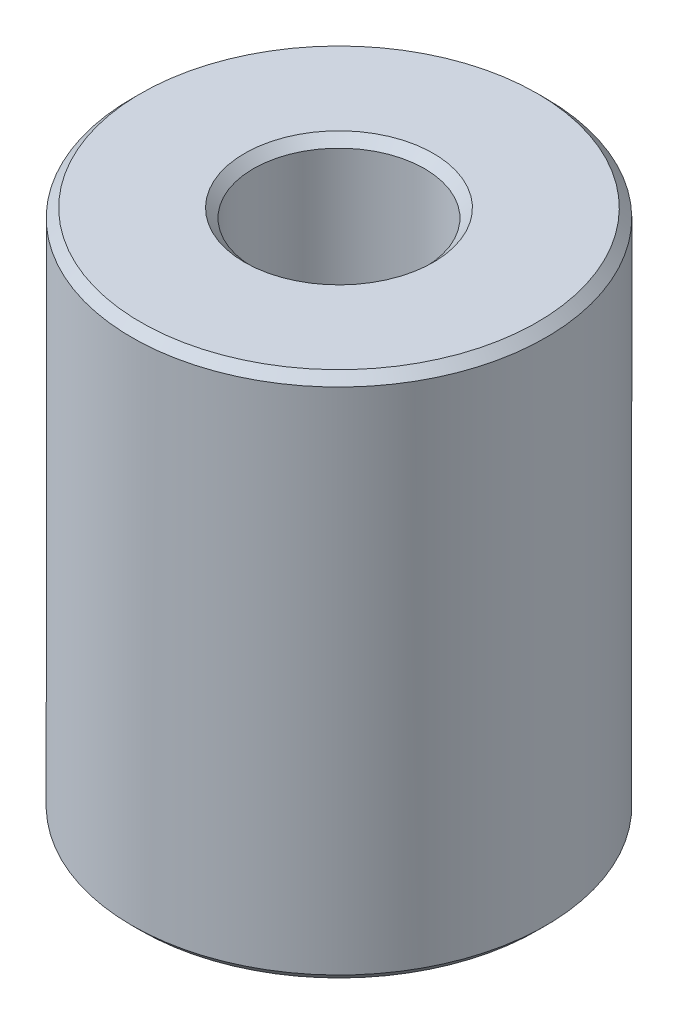
ISO-10303-21;
HEADER;
FILE_DESCRIPTION(('STEP AP214'),'2;1');
FILE_NAME('part.step','',(''),(''),'','','');
FILE_SCHEMA(('AUTOMOTIVE_DESIGN { 1 0 10303 214 1 1 1 1 }'));
ENDSEC;
DATA;
#1=APPLICATION_CONTEXT('core data for automotive mechanical design processes');
#2=APPLICATION_PROTOCOL_DEFINITION('international standard','automotive_design',2000,#1);
#3=PRODUCT_CONTEXT('',#1,'mechanical');
#4=PRODUCT('Part','Part','',(#3));
#5=PRODUCT_RELATED_PRODUCT_CATEGORY('part','',(#4));
#6=PRODUCT_DEFINITION_FORMATION('','',#4);
#7=PRODUCT_DEFINITION_CONTEXT('part definition',#1,'design');
#8=PRODUCT_DEFINITION('design','',#6,#7);
#9=PRODUCT_DEFINITION_SHAPE('','',#8);
#10=(LENGTH_UNIT() NAMED_UNIT(*) SI_UNIT(.MILLI.,.METRE.));
#11=(NAMED_UNIT(*) PLANE_ANGLE_UNIT() SI_UNIT($,.RADIAN.));
#12=(NAMED_UNIT(*) SI_UNIT($,.STERADIAN.) SOLID_ANGLE_UNIT());
#13=UNCERTAINTY_MEASURE_WITH_UNIT(LENGTH_MEASURE(1.E-05),#10,'distance_accuracy_value','');
#14=(GEOMETRIC_REPRESENTATION_CONTEXT(3) GLOBAL_UNCERTAINTY_ASSIGNED_CONTEXT((#13)) GLOBAL_UNIT_ASSIGNED_CONTEXT((#10,
#11,#12)) REPRESENTATION_CONTEXT('',''));
#15=CARTESIAN_POINT('',(0.,0.,0.));
#16=DIRECTION('',(0.,0.,1.));
#17=DIRECTION('',(1.,0.,0.));
#18=AXIS2_PLACEMENT_3D('',#15,#16,#17);
#19=CARTESIAN_POINT('',(0.,152.674371253486,0.));
#20=DIRECTION('',(0.,-1.,0.));
#21=DIRECTION('',(0.,0.,-1.));
#22=AXIS2_PLACEMENT_3D('',#19,#20,#21);
#23=CYLINDRICAL_SURFACE('',#22,60.);
#24=CARTESIAN_POINT('',(0.,2.55552358981329,0.));
#25=DIRECTION('',(0.,1.,0.));
#26=DIRECTION('',(0.,0.,1.));
#27=AXIS2_PLACEMENT_3D('',#24,#25,#26);
#28=CIRCLE('',#27,60.);
#29=CARTESIAN_POINT('',(0.,2.55552358981329,60.));
#30=VERTEX_POINT('',#29);
#31=EDGE_CURVE('E10',#30,#30,#28,.T.);
#32=ORIENTED_EDGE('',*,*,#31,.T.);
#33=EDGE_LOOP('',(#32));
#34=FACE_BOUND('',#33,.T.);
#35=CARTESIAN_POINT('',(0.,150.118847663672,0.));
#36=DIRECTION('',(0.,1.,0.));
#37=DIRECTION('',(0.,0.,1.));
#38=AXIS2_PLACEMENT_3D('',#35,#36,#37);
#39=CIRCLE('',#38,60.);
#40=CARTESIAN_POINT('',(0.,150.118847663672,-60.));
#41=VERTEX_POINT('',#40);
#42=EDGE_CURVE('E50',#41,#41,#39,.F.);
#43=ORIENTED_EDGE('',*,*,#42,.T.);
#44=EDGE_LOOP('',(#43));
#45=FACE_BOUND('',#44,.T.);
#46=ADVANCED_FACE('F39',(#34,#45),#23,.T.);
#47=CARTESIAN_POINT('',(0.,152.674371253486,0.));
#48=DIRECTION('',(0.,1.,0.));
#49=DIRECTION('',(0.,0.,1.));
#50=AXIS2_PLACEMENT_3D('',#47,#48,#49);
#51=PLANE('',#50);
#52=CARTESIAN_POINT('',(0.,152.674371253486,0.));
#53=DIRECTION('',(0.,1.,0.));
#54=DIRECTION('',(0.,0.,1.));
#55=AXIS2_PLACEMENT_3D('',#52,#53,#54);
#56=CIRCLE('',#55,27.3543819802028);
#57=CARTESIAN_POINT('',(0.,152.674371253486,27.3543819802027));
#58=VERTEX_POINT('',#57);
#59=EDGE_CURVE('E58',#58,#58,#56,.F.);
#60=ORIENTED_EDGE('',*,*,#59,.T.);
#61=EDGE_LOOP('',(#60));
#62=FACE_BOUND('',#61,.T.);
#63=CARTESIAN_POINT('',(0.,152.674371253486,0.));
#64=DIRECTION('',(0.,1.,0.));
#65=DIRECTION('',(0.,0.,1.));
#66=AXIS2_PLACEMENT_3D('',#63,#64,#65);
#67=CIRCLE('',#66,57.4444764101867);
#68=CARTESIAN_POINT('',(0.,152.674371253486,-57.4444764101867));
#69=VERTEX_POINT('',#68);
#70=EDGE_CURVE('E61',#69,#69,#67,.T.);
#71=ORIENTED_EDGE('',*,*,#70,.T.);
#72=EDGE_LOOP('',(#71));
#73=FACE_BOUND('',#72,.T.);
#74=ADVANCED_FACE('F88',(#62,#73),#51,.T.);
#75=CARTESIAN_POINT('',(0.,0.,0.));
#76=DIRECTION('',(0.,1.,0.));
#77=DIRECTION('',(0.,0.,1.));
#78=AXIS2_PLACEMENT_3D('',#75,#76,#77);
#79=PLANE('',#78);
#80=CARTESIAN_POINT('',(0.,0.,0.));
#81=DIRECTION('',(0.,1.,0.));
#82=DIRECTION('',(0.,0.,1.));
#83=AXIS2_PLACEMENT_3D('',#80,#81,#82);
#84=CIRCLE('',#83,27.3543819802027);
#85=CARTESIAN_POINT('',(0.,0.,27.3543819802027));
#86=VERTEX_POINT('',#85);
#87=EDGE_CURVE('E51',#86,#86,#84,.T.);
#88=ORIENTED_EDGE('',*,*,#87,.T.);
#89=EDGE_LOOP('',(#88));
#90=FACE_BOUND('',#89,.T.);
#91=CARTESIAN_POINT('',(0.,0.,0.));
#92=DIRECTION('',(0.,1.,0.));
#93=DIRECTION('',(0.,0.,1.));
#94=AXIS2_PLACEMENT_3D('',#91,#92,#93);
#95=CIRCLE('',#94,57.4444764101867);
#96=CARTESIAN_POINT('',(0.,0.,57.4444764101867));
#97=VERTEX_POINT('',#96);
#98=EDGE_CURVE('E54',#97,#97,#95,.F.);
#99=ORIENTED_EDGE('',*,*,#98,.T.);
#100=EDGE_LOOP('',(#99));
#101=FACE_BOUND('',#100,.T.);
#102=ADVANCED_FACE('F83',(#90,#101),#79,.F.);
#103=CARTESIAN_POINT('',(0.,152.674371253486,0.));
#104=DIRECTION('',(0.,-1.,0.));
#105=DIRECTION('',(0.,0.,-1.));
#106=AXIS2_PLACEMENT_3D('',#103,#104,#105);
#107=CYLINDRICAL_SURFACE('',#106,24.7988583903894);
#108=CARTESIAN_POINT('',(0.,150.118847663672,0.));
#109=DIRECTION('',(0.,1.,0.));
#110=DIRECTION('',(0.,0.,1.));
#111=AXIS2_PLACEMENT_3D('',#108,#109,#110);
#112=CIRCLE('',#111,24.7988583903894);
#113=CARTESIAN_POINT('',(0.,150.118847663672,24.7988583903894));
#114=VERTEX_POINT('',#113);
#115=EDGE_CURVE('E67',#114,#114,#112,.T.);
#116=ORIENTED_EDGE('',*,*,#115,.T.);
#117=EDGE_LOOP('',(#116));
#118=FACE_BOUND('',#117,.T.);
#119=CARTESIAN_POINT('',(0.,2.55552358981329,0.));
#120=DIRECTION('',(0.,1.,0.));
#121=DIRECTION('',(0.,0.,1.));
#122=AXIS2_PLACEMENT_3D('',#119,#120,#121);
#123=CIRCLE('',#122,24.7988583903894);
#124=CARTESIAN_POINT('',(0.,2.55552358981329,24.7988583903894));
#125=VERTEX_POINT('',#124);
#126=EDGE_CURVE('E69',#125,#125,#123,.F.);
#127=ORIENTED_EDGE('',*,*,#126,.T.);
#128=EDGE_LOOP('',(#127));
#129=FACE_BOUND('',#128,.T.);
#130=ADVANCED_FACE('F71',(#118,#129),#107,.F.);
#131=CARTESIAN_POINT('',(0.,150.118847663672,0.));
#132=DIRECTION('',(0.,1.,0.));
#133=DIRECTION('',(0.,0.,1.));
#134=AXIS2_PLACEMENT_3D('',#131,#132,#133);
#135=CONICAL_SURFACE('',#134,24.7988583903894,0.785398163397447);
#136=CARTESIAN_POINT('',(0.,152.674371253486,27.3543819802027));
#137=CARTESIAN_POINT('',(0.,152.647751216092,27.3277619428089));
#138=CARTESIAN_POINT('',(0.,152.621131178698,27.301141905415));
#139=CARTESIAN_POINT('',(0.,152.56789110391,27.2479018306272));
#140=CARTESIAN_POINT('',(0.,152.541271066516,27.2212817932333));
#141=CARTESIAN_POINT('',(0.,152.488030991728,27.1680417184455));
#142=CARTESIAN_POINT('',(0.,152.461410954334,27.1414216810516));
#143=CARTESIAN_POINT('',(0.,152.408170879547,27.0881816062639));
#144=CARTESIAN_POINT('',(0.,152.381550842153,27.06156156887));
#145=CARTESIAN_POINT('',(0.,152.328310767365,27.0083214940822));
#146=CARTESIAN_POINT('',(0.,152.301690729971,26.9817014566883));
#147=CARTESIAN_POINT('',(0.,152.248450655183,26.9284613819005));
#148=CARTESIAN_POINT('',(0.,152.221830617789,26.9018413445066));
#149=CARTESIAN_POINT('',(0.,152.168590543002,26.8486012697189));
#150=CARTESIAN_POINT('',(0.,152.141970505608,26.821981232325));
#151=CARTESIAN_POINT('',(0.,152.08873043082,26.7687411575372));
#152=CARTESIAN_POINT('',(0.,152.062110393426,26.7421211201433));
#153=CARTESIAN_POINT('',(0.,152.008870318638,26.6888810453555));
#154=CARTESIAN_POINT('',(0.,151.982250281244,26.6622610079616));
#155=CARTESIAN_POINT('',(0.,151.929010206457,26.6090209331739));
#156=CARTESIAN_POINT('',(0.,151.902390169063,26.58240089578));
#157=CARTESIAN_POINT('',(0.,151.849150094275,26.5291608209922));
#158=CARTESIAN_POINT('',(0.,151.822530056881,26.5025407835983));
#159=CARTESIAN_POINT('',(0.,151.769289982093,26.4493007088105));
#160=CARTESIAN_POINT('',(0.,151.742669944699,26.4226806714166));
#161=CARTESIAN_POINT('',(0.,151.689429869912,26.3694405966289));
#162=CARTESIAN_POINT('',(0.,151.662809832518,26.342820559235));
#163=CARTESIAN_POINT('',(0.,151.60956975773,26.2895804844472));
#164=CARTESIAN_POINT('',(0.,151.582949720336,26.2629604470533));
#165=CARTESIAN_POINT('',(0.,151.529709645548,26.2097203722655));
#166=CARTESIAN_POINT('',(0.,151.503089608154,26.1831003348716));
#167=CARTESIAN_POINT('',(0.,151.449849533367,26.1298602600839));
#168=CARTESIAN_POINT('',(0.,151.423229495973,26.10324022269));
#169=CARTESIAN_POINT('',(0.,151.369989421185,26.0500001479022));
#170=CARTESIAN_POINT('',(0.,151.343369383791,26.0233801105083));
#171=CARTESIAN_POINT('',(0.,151.290129309003,25.9701400357205));
#172=CARTESIAN_POINT('',(0.,151.263509271609,25.9435199983266));
#173=CARTESIAN_POINT('',(0.,151.210269196822,25.8902799235389));
#174=CARTESIAN_POINT('',(0.,151.183649159428,25.863659886145));
#175=CARTESIAN_POINT('',(0.,151.13040908464,25.8104198113572));
#176=CARTESIAN_POINT('',(0.,151.103789047246,25.7837997739633));
#177=CARTESIAN_POINT('',(0.,151.050548972458,25.7305596991755));
#178=CARTESIAN_POINT('',(0.,151.023928935064,25.7039396617816));
#179=CARTESIAN_POINT('',(0.,150.970688860277,25.6506995869939));
#180=CARTESIAN_POINT('',(0.,150.944068822883,25.6240795496));
#181=CARTESIAN_POINT('',(0.,150.890828748095,25.5708394748122));
#182=CARTESIAN_POINT('',(0.,150.864208710701,25.5442194374183));
#183=CARTESIAN_POINT('',(0.,150.810968635913,25.4909793626305));
#184=CARTESIAN_POINT('',(0.,150.784348598519,25.4643593252366));
#185=CARTESIAN_POINT('',(0.,150.731108523732,25.4111192504489));
#186=CARTESIAN_POINT('',(0.,150.704488486338,25.384499213055));
#187=CARTESIAN_POINT('',(0.,150.65124841155,25.3312591382672));
#188=CARTESIAN_POINT('',(0.,150.624628374156,25.3046391008733));
#189=CARTESIAN_POINT('',(0.,150.571388299368,25.2513990260855));
#190=CARTESIAN_POINT('',(0.,150.544768261974,25.2247789886916));
#191=CARTESIAN_POINT('',(0.,150.491528187187,25.1715389139039));
#192=CARTESIAN_POINT('',(0.,150.464908149793,25.14491887651));
#193=CARTESIAN_POINT('',(0.,150.411668075005,25.0916788017222));
#194=CARTESIAN_POINT('',(0.,150.385048037611,25.0650587643283));
#195=CARTESIAN_POINT('',(0.,150.331807962823,25.0118186895405));
#196=CARTESIAN_POINT('',(0.,150.305187925429,24.9851986521466));
#197=CARTESIAN_POINT('',(0.,150.251947850642,24.9319585773589));
#198=CARTESIAN_POINT('',(0.,150.225327813248,24.905338539965));
#199=CARTESIAN_POINT('',(0.,150.17208773846,24.8520984651772));
#200=CARTESIAN_POINT('',(0.,150.145467701066,24.8254784277833));
#201=CARTESIAN_POINT('',(0.,150.118847663672,24.7988583903894));
#202=B_SPLINE_CURVE_WITH_KNOTS('',3,(#136,#137,#138,#139,#140,#141,#142,#143,#144,#145,#146,
#147,#148,#149,#150,#151,#152,#153,#154,#155,#156,#157,#158,#159,#160,#161,#162,#163,#164,#165,
#166,#167,#168,#169,#170,#171,#172,#173,#174,#175,#176,#177,#178,#179,#180,#181,#182,#183,#184,
#185,#186,#187,#188,#189,#190,#191,#192,#193,#194,#195,#196,#197,#198,#199,#200,#201),
.UNSPECIFIED.,.F.,.F.,(4,2,2,2,2,2,2,2,2,2,2,2,2,2,2,2,2,2,2,2,2,2,2,2,2,2,2,2,2,2,2,2,4),(0.,
0.112939253739949,0.2258785074799,0.338817761219852,0.451757014959803,0.564696268699752,
0.677635522439703,0.790574776179652,0.903514029919604,1.01645328365956,1.12939253739951,
1.24233179113946,1.35527104487941,1.46821029861936,1.58114955235931,1.69408880609926,
1.80702805983921,1.91996731357916,2.03290656731911,2.14584582105906,2.25878507479901,
2.37172432853896,2.48466358227891,2.59760283601886,2.71054208975881,2.82348134349876,
2.93642059723872,3.04935985097867,3.16229910471862,3.27523835845857,3.38817761219852,
3.50111686593847,3.6140561196784),.UNSPECIFIED.);
#203=EDGE_CURVE('BSEAM77',#58,#114,#202,.T.);
#204=ORIENTED_EDGE('',*,*,#59,.F.);
#205=ORIENTED_EDGE('',*,*,#115,.F.);
#206=ORIENTED_EDGE('',*,*,#203,.T.);
#207=ORIENTED_EDGE('',*,*,#203,.F.);
#208=EDGE_LOOP('',(#204,#206,#205,#207));
#209=FACE_BOUND('',#208,.T.);
#210=ADVANCED_FACE('F77',(#209),#135,.F.);
#211=CARTESIAN_POINT('',(0.,0.,0.));
#212=DIRECTION('',(0.,-1.,0.));
#213=DIRECTION('',(0.,0.,-1.));
#214=AXIS2_PLACEMENT_3D('',#211,#212,#213);
#215=CONICAL_SURFACE('',#214,27.3543819802027,0.785398163397442);
#216=ORIENTED_EDGE('',*,*,#126,.F.);
#217=EDGE_LOOP('',(#216));
#218=FACE_BOUND('',#217,.T.);
#219=ORIENTED_EDGE('',*,*,#87,.F.);
#220=EDGE_LOOP('',(#219));
#221=FACE_BOUND('',#220,.T.);
#222=ADVANCED_FACE('F73',(#218,#221),#215,.F.);
#223=CARTESIAN_POINT('',(0.,2.55552358981329,0.));
#224=DIRECTION('',(0.,1.,0.));
#225=DIRECTION('',(0.,0.,1.));
#226=AXIS2_PLACEMENT_3D('',#223,#224,#225);
#227=CONICAL_SURFACE('',#226,60.,0.785398163397454);
#228=ORIENTED_EDGE('',*,*,#98,.F.);
#229=EDGE_LOOP('',(#228));
#230=FACE_BOUND('',#229,.T.);
#231=ORIENTED_EDGE('',*,*,#31,.F.);
#232=EDGE_LOOP('',(#231));
#233=FACE_BOUND('',#232,.T.);
#234=ADVANCED_FACE('F76',(#230,#233),#227,.T.);
#235=CARTESIAN_POINT('',(0.,152.674371253486,0.));
#236=DIRECTION('',(0.,-1.,0.));
#237=DIRECTION('',(0.,0.,-1.));
#238=AXIS2_PLACEMENT_3D('',#235,#236,#237);
#239=CONICAL_SURFACE('',#238,57.4444764101867,0.785398163397443);
#240=CARTESIAN_POINT('',(0.,150.118847663672,-60.));
#241=CARTESIAN_POINT('',(0.,150.145467701066,-59.9733799626061));
#242=CARTESIAN_POINT('',(0.,150.17208773846,-59.9467599252122));
#243=CARTESIAN_POINT('',(0.,150.225327813248,-59.8935198504245));
#244=CARTESIAN_POINT('',(0.,150.251947850642,-59.8668998130306));
#245=CARTESIAN_POINT('',(0.,150.305187925429,-59.8136597382428));
#246=CARTESIAN_POINT('',(0.,150.331807962823,-59.7870397008489));
#247=CARTESIAN_POINT('',(0.,150.385048037611,-59.7337996260611));
#248=CARTESIAN_POINT('',(0.,150.411668075005,-59.7071795886672));
#249=CARTESIAN_POINT('',(0.,150.464908149793,-59.6539395138795));
#250=CARTESIAN_POINT('',(0.,150.491528187187,-59.6273194764856));
#251=CARTESIAN_POINT('',(0.,150.544768261974,-59.5740794016978));
#252=CARTESIAN_POINT('',(0.,150.571388299368,-59.5474593643039));
#253=CARTESIAN_POINT('',(0.,150.624628374156,-59.4942192895161));
#254=CARTESIAN_POINT('',(0.,150.65124841155,-59.4675992521222));
#255=CARTESIAN_POINT('',(0.,150.704488486338,-59.4143591773345));
#256=CARTESIAN_POINT('',(0.,150.731108523732,-59.3877391399406));
#257=CARTESIAN_POINT('',(0.,150.784348598519,-59.3344990651528));
#258=CARTESIAN_POINT('',(0.,150.810968635913,-59.3078790277589));
#259=CARTESIAN_POINT('',(0.,150.864208710701,-59.2546389529711));
#260=CARTESIAN_POINT('',(0.,150.890828748095,-59.2280189155772));
#261=CARTESIAN_POINT('',(0.,150.944068822883,-59.1747788407895));
#262=CARTESIAN_POINT('',(0.,150.970688860277,-59.1481588033956));
#263=CARTESIAN_POINT('',(0.,151.023928935064,-59.0949187286078));
#264=CARTESIAN_POINT('',(0.,151.050548972458,-59.0682986912139));
#265=CARTESIAN_POINT('',(0.,151.103789047246,-59.0150586164261));
#266=CARTESIAN_POINT('',(0.,151.13040908464,-58.9884385790322));
#267=CARTESIAN_POINT('',(0.,151.183649159428,-58.9351985042445));
#268=CARTESIAN_POINT('',(0.,151.210269196822,-58.9085784668506));
#269=CARTESIAN_POINT('',(0.,151.263509271609,-58.8553383920628));
#270=CARTESIAN_POINT('',(0.,151.290129309003,-58.8287183546689));
#271=CARTESIAN_POINT('',(0.,151.343369383791,-58.7754782798811));
#272=CARTESIAN_POINT('',(0.,151.369989421185,-58.7488582424872));
#273=CARTESIAN_POINT('',(0.,151.423229495973,-58.6956181676995));
#274=CARTESIAN_POINT('',(0.,151.449849533367,-58.6689981303056));
#275=CARTESIAN_POINT('',(0.,151.503089608154,-58.6157580555178));
#276=CARTESIAN_POINT('',(0.,151.529709645548,-58.5891380181239));
#277=CARTESIAN_POINT('',(0.,151.582949720336,-58.5358979433361));
#278=CARTESIAN_POINT('',(0.,151.60956975773,-58.5092779059422));
#279=CARTESIAN_POINT('',(0.,151.662809832518,-58.4560378311545));
#280=CARTESIAN_POINT('',(0.,151.689429869912,-58.4294177937606));
#281=CARTESIAN_POINT('',(0.,151.742669944699,-58.3761777189728));
#282=CARTESIAN_POINT('',(0.,151.769289982093,-58.3495576815789));
#283=CARTESIAN_POINT('',(0.,151.822530056881,-58.2963176067911));
#284=CARTESIAN_POINT('',(0.,151.849150094275,-58.2696975693972));
#285=CARTESIAN_POINT('',(0.,151.902390169063,-58.2164574946095));
#286=CARTESIAN_POINT('',(0.,151.929010206457,-58.1898374572156));
#287=CARTESIAN_POINT('',(0.,151.982250281244,-58.1365973824278));
#288=CARTESIAN_POINT('',(0.,152.008870318638,-58.1099773450339));
#289=CARTESIAN_POINT('',(0.,152.062110393426,-58.0567372702461));
#290=CARTESIAN_POINT('',(0.,152.08873043082,-58.0301172328522));
#291=CARTESIAN_POINT('',(0.,152.141970505608,-57.9768771580645));
#292=CARTESIAN_POINT('',(0.,152.168590543002,-57.9502571206706));
#293=CARTESIAN_POINT('',(0.,152.221830617789,-57.8970170458828));
#294=CARTESIAN_POINT('',(0.,152.248450655183,-57.8703970084889));
#295=CARTESIAN_POINT('',(0.,152.301690729971,-57.8171569337011));
#296=CARTESIAN_POINT('',(0.,152.328310767365,-57.7905368963073));
#297=CARTESIAN_POINT('',(0.,152.381550842153,-57.7372968215195));
#298=CARTESIAN_POINT('',(0.,152.408170879547,-57.7106767841256));
#299=CARTESIAN_POINT('',(0.,152.461410954334,-57.6574367093378));
#300=CARTESIAN_POINT('',(0.,152.488030991728,-57.6308166719439));
#301=CARTESIAN_POINT('',(0.,152.541271066516,-57.5775765971561));
#302=CARTESIAN_POINT('',(0.,152.56789110391,-57.5509565597623));
#303=CARTESIAN_POINT('',(0.,152.621131178698,-57.4977164849745));
#304=CARTESIAN_POINT('',(0.,152.647751216092,-57.4710964475806));
#305=CARTESIAN_POINT('',(0.,152.674371253486,-57.4444764101867));
#306=B_SPLINE_CURVE_WITH_KNOTS('',3,(#240,#241,#242,#243,#244,#245,#246,#247,#248,#249,#250,
#251,#252,#253,#254,#255,#256,#257,#258,#259,#260,#261,#262,#263,#264,#265,#266,#267,#268,#269,
#270,#271,#272,#273,#274,#275,#276,#277,#278,#279,#280,#281,#282,#283,#284,#285,#286,#287,#288,
#289,#290,#291,#292,#293,#294,#295,#296,#297,#298,#299,#300,#301,#302,#303,#304,#305),
.UNSPECIFIED.,.F.,.F.,(4,2,2,2,2,2,2,2,2,2,2,2,2,2,2,2,2,2,2,2,2,2,2,2,2,2,2,2,2,2,2,2,4),(0.,
0.112939253739951,0.225878507479898,0.338817761219849,0.451757014959801,0.564696268699752,
0.677635522439698,0.79057477617965,0.903514029919601,1.01645328365955,1.1293925373995,
1.24233179113945,1.3552710448794,1.46821029861935,1.5811495523593,1.69408880609925,
1.8070280598392,1.91996731357915,2.0329065673191,2.14584582105905,2.258785074799,
2.37172432853895,2.4846635822789,2.59760283601885,2.7105420897588,2.82348134349875,
2.93642059723871,3.04935985097865,3.1622991047186,3.27523835845855,3.3881776121985,
3.50111686593845,3.6140561196784),.UNSPECIFIED.);
#307=EDGE_CURVE('BSEAM45',#41,#69,#306,.T.);
#308=ORIENTED_EDGE('',*,*,#42,.F.);
#309=ORIENTED_EDGE('',*,*,#70,.F.);
#310=ORIENTED_EDGE('',*,*,#307,.T.);
#311=ORIENTED_EDGE('',*,*,#307,.F.);
#312=EDGE_LOOP('',(#308,#310,#309,#311));
#313=FACE_BOUND('',#312,.T.);
#314=ADVANCED_FACE('F45',(#313),#239,.T.);
#315=CLOSED_SHELL('',(#46,#74,#102,#130,#210,#222,#234,#314));
#316=MANIFOLD_SOLID_BREP('B2',#315);
#317=ADVANCED_BREP_SHAPE_REPRESENTATION('',(#18,#316),#14);
#318=SHAPE_DEFINITION_REPRESENTATION(#9,#317);
ENDSEC;
END-ISO-10303-21;
